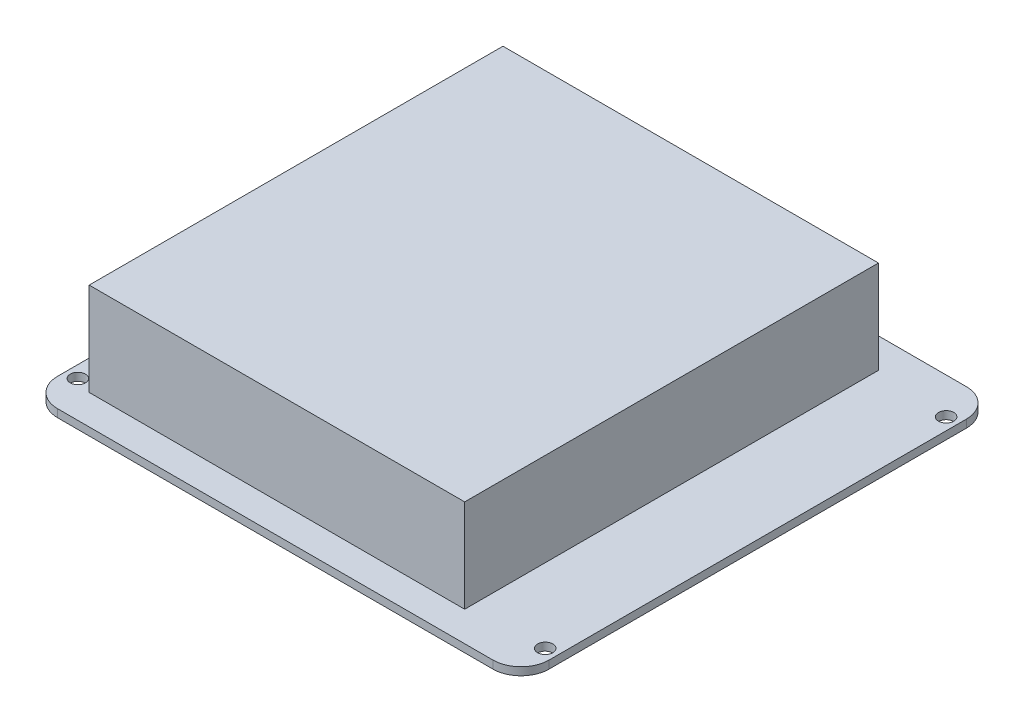
ISO-10303-21;
HEADER;
FILE_DESCRIPTION(('STEP AP214'),'2;1');
FILE_NAME('part.step','',(''),(''),'','','');
FILE_SCHEMA(('AUTOMOTIVE_DESIGN { 1 0 10303 214 1 1 1 1 }'));
ENDSEC;
DATA;
#1=APPLICATION_CONTEXT('core data for automotive mechanical design processes');
#2=APPLICATION_PROTOCOL_DEFINITION('international standard','automotive_design',2000,#1);
#3=PRODUCT_CONTEXT('',#1,'mechanical');
#4=PRODUCT('Part','Part','',(#3));
#5=PRODUCT_RELATED_PRODUCT_CATEGORY('part','',(#4));
#6=PRODUCT_DEFINITION_FORMATION('','',#4);
#7=PRODUCT_DEFINITION_CONTEXT('part definition',#1,'design');
#8=PRODUCT_DEFINITION('design','',#6,#7);
#9=PRODUCT_DEFINITION_SHAPE('','',#8);
#10=(LENGTH_UNIT() NAMED_UNIT(*) SI_UNIT(.MILLI.,.METRE.));
#11=(NAMED_UNIT(*) PLANE_ANGLE_UNIT() SI_UNIT($,.RADIAN.));
#12=(NAMED_UNIT(*) SI_UNIT($,.STERADIAN.) SOLID_ANGLE_UNIT());
#13=UNCERTAINTY_MEASURE_WITH_UNIT(LENGTH_MEASURE(1.E-05),#10,'distance_accuracy_value','');
#14=(GEOMETRIC_REPRESENTATION_CONTEXT(3) GLOBAL_UNCERTAINTY_ASSIGNED_CONTEXT((#13)) GLOBAL_UNIT_ASSIGNED_CONTEXT((#10,
#11,#12)) REPRESENTATION_CONTEXT('',''));
#15=CARTESIAN_POINT('',(0.,0.,0.));
#16=DIRECTION('',(0.,0.,1.));
#17=DIRECTION('',(1.,0.,0.));
#18=AXIS2_PLACEMENT_3D('',#15,#16,#17);
#19=CARTESIAN_POINT('',(0.,0.,0.));
#20=DIRECTION('',(0.,1.,0.));
#21=DIRECTION('',(0.,0.,1.));
#22=AXIS2_PLACEMENT_3D('',#19,#20,#21);
#23=PLANE('',#22);
#24=CARTESIAN_POINT('',(47.5,0.,40.75));
#25=DIRECTION('',(0.,1.,0.));
#26=DIRECTION('',(0.,0.,1.));
#27=AXIS2_PLACEMENT_3D('',#24,#25,#26);
#28=CIRCLE('',#27,1.54999999999999);
#29=CARTESIAN_POINT('',(47.5,0.,42.3));
#30=VERTEX_POINT('',#29);
#31=EDGE_CURVE('E194',#30,#30,#28,.T.);
#32=ORIENTED_EDGE('',*,*,#31,.T.);
#33=EDGE_LOOP('',(#32));
#34=FACE_BOUND('',#33,.T.);
#35=CARTESIAN_POINT('',(-47.5,0.,40.75));
#36=DIRECTION('',(0.,1.,0.));
#37=DIRECTION('',(0.,0.,1.));
#38=AXIS2_PLACEMENT_3D('',#35,#36,#37);
#39=CIRCLE('',#38,1.55);
#40=CARTESIAN_POINT('',(-47.5,0.,42.3));
#41=VERTEX_POINT('',#40);
#42=EDGE_CURVE('E210',#41,#41,#39,.T.);
#43=ORIENTED_EDGE('',*,*,#42,.T.);
#44=EDGE_LOOP('',(#43));
#45=FACE_BOUND('',#44,.T.);
#46=CARTESIAN_POINT('',(-47.5,0.,-40.75));
#47=DIRECTION('',(0.,1.,0.));
#48=DIRECTION('',(0.,0.,1.));
#49=AXIS2_PLACEMENT_3D('',#46,#47,#48);
#50=CIRCLE('',#49,1.55);
#51=CARTESIAN_POINT('',(-47.5,0.,-39.2));
#52=VERTEX_POINT('',#51);
#53=EDGE_CURVE('E216',#52,#52,#50,.T.);
#54=ORIENTED_EDGE('',*,*,#53,.T.);
#55=EDGE_LOOP('',(#54));
#56=FACE_BOUND('',#55,.T.);
#57=CARTESIAN_POINT('',(47.5,0.,-40.75));
#58=DIRECTION('',(0.,1.,0.));
#59=DIRECTION('',(0.,0.,1.));
#60=AXIS2_PLACEMENT_3D('',#57,#58,#59);
#61=CIRCLE('',#60,1.54999999999999);
#62=CARTESIAN_POINT('',(47.5,0.,-39.2));
#63=VERTEX_POINT('',#62);
#64=EDGE_CURVE('E222',#63,#63,#61,.T.);
#65=ORIENTED_EDGE('',*,*,#64,.T.);
#66=EDGE_LOOP('',(#65));
#67=FACE_BOUND('',#66,.T.);
#68=DIRECTION('',(-1.,0.,0.));
#69=VECTOR('',#68,1.);
#70=CARTESIAN_POINT('',(-49.955000039,0.,-48.125));
#71=LINE('',#70,#69);
#72=CARTESIAN_POINT('',(44.255000039,0.,-48.125));
#73=VERTEX_POINT('',#72);
#74=CARTESIAN_POINT('',(-44.255000039,0.,-48.125));
#75=VERTEX_POINT('',#74);
#76=EDGE_CURVE('E235',#73,#75,#71,.T.);
#77=ORIENTED_EDGE('',*,*,#76,.F.);
#78=CARTESIAN_POINT('',(44.255000039,0.,-42.425));
#79=DIRECTION('',(0.,1.,0.));
#80=DIRECTION('',(0.,0.,1.));
#81=AXIS2_PLACEMENT_3D('',#78,#79,#80);
#82=CIRCLE('',#81,5.7);
#83=CARTESIAN_POINT('',(49.955000039,0.,-42.425));
#84=VERTEX_POINT('',#83);
#85=EDGE_CURVE('E265',#73,#84,#82,.F.);
#86=ORIENTED_EDGE('',*,*,#85,.T.);
#87=DIRECTION('',(0.,0.,-1.));
#88=VECTOR('',#87,1.);
#89=CARTESIAN_POINT('',(49.955000039,0.,-48.125));
#90=LINE('',#89,#88);
#91=CARTESIAN_POINT('',(49.9550000390001,0.,42.425));
#92=VERTEX_POINT('',#91);
#93=EDGE_CURVE('E250',#92,#84,#90,.T.);
#94=ORIENTED_EDGE('',*,*,#93,.F.);
#95=CARTESIAN_POINT('',(44.2550000390001,0.,42.425));
#96=DIRECTION('',(0.,1.,0.));
#97=DIRECTION('',(0.,0.,1.));
#98=AXIS2_PLACEMENT_3D('',#95,#96,#97);
#99=CIRCLE('',#98,5.7);
#100=CARTESIAN_POINT('',(44.2550000390001,0.,48.125));
#101=VERTEX_POINT('',#100);
#102=EDGE_CURVE('E263',#92,#101,#99,.F.);
#103=ORIENTED_EDGE('',*,*,#102,.T.);
#104=DIRECTION('',(1.,0.,0.));
#105=VECTOR('',#104,1.);
#106=CARTESIAN_POINT('',(-49.955000039,0.,48.125));
#107=LINE('',#106,#105);
#108=CARTESIAN_POINT('',(-44.255000039,0.,48.125));
#109=VERTEX_POINT('',#108);
#110=EDGE_CURVE('E247',#109,#101,#107,.T.);
#111=ORIENTED_EDGE('',*,*,#110,.F.);
#112=CARTESIAN_POINT('',(-44.255000039,0.,42.425));
#113=DIRECTION('',(0.,1.,0.));
#114=DIRECTION('',(0.,0.,1.));
#115=AXIS2_PLACEMENT_3D('',#112,#113,#114);
#116=CIRCLE('',#115,5.7);
#117=CARTESIAN_POINT('',(-49.955000039,0.,42.425));
#118=VERTEX_POINT('',#117);
#119=EDGE_CURVE('E259',#109,#118,#116,.F.);
#120=ORIENTED_EDGE('',*,*,#119,.T.);
#121=DIRECTION('',(0.,0.,1.));
#122=VECTOR('',#121,1.);
#123=CARTESIAN_POINT('',(-49.955000039,0.,-48.125));
#124=LINE('',#123,#122);
#125=CARTESIAN_POINT('',(-49.955000039,0.,-42.425));
#126=VERTEX_POINT('',#125);
#127=EDGE_CURVE('E228',#126,#118,#124,.T.);
#128=ORIENTED_EDGE('',*,*,#127,.F.);
#129=CARTESIAN_POINT('',(-44.255000039,0.,-42.425));
#130=DIRECTION('',(0.,1.,0.));
#131=DIRECTION('',(0.,0.,1.));
#132=AXIS2_PLACEMENT_3D('',#129,#130,#131);
#133=CIRCLE('',#132,5.7);
#134=EDGE_CURVE('E261',#126,#75,#133,.F.);
#135=ORIENTED_EDGE('',*,*,#134,.T.);
#136=EDGE_LOOP('',(#77,#86,#94,#103,#111,#120,#128,#135));
#137=FACE_BOUND('',#136,.T.);
#138=DIRECTION('',(0.,0.,1.));
#139=VECTOR('',#138,1.);
#140=CARTESIAN_POINT('',(-7.135000039,0.,6.22500000000002));
#141=LINE('',#140,#139);
#142=CARTESIAN_POINT('',(-7.135000039,0.,-0.324999999999982));
#143=VERTEX_POINT('',#142);
#144=CARTESIAN_POINT('',(-7.135000039,0.,6.22500000000002));
#145=VERTEX_POINT('',#144);
#146=EDGE_CURVE('E168',#143,#145,#141,.T.);
#147=ORIENTED_EDGE('',*,*,#146,.F.);
#148=DIRECTION('',(1.,0.,0.));
#149=VECTOR('',#148,1.);
#150=CARTESIAN_POINT('',(-7.135000039,0.,-0.324999999999982));
#151=LINE('',#150,#149);
#152=CARTESIAN_POINT('',(-14.095000039,0.,-0.324999999999983));
#153=VERTEX_POINT('',#152);
#154=EDGE_CURVE('E165',#153,#143,#151,.T.);
#155=ORIENTED_EDGE('',*,*,#154,.F.);
#156=DIRECTION('',(0.,0.,-1.));
#157=VECTOR('',#156,1.);
#158=CARTESIAN_POINT('',(-14.095000039,0.,6.22500000000001));
#159=LINE('',#158,#157);
#160=CARTESIAN_POINT('',(-14.095000039,0.,6.22500000000001));
#161=VERTEX_POINT('',#160);
#162=EDGE_CURVE('E55',#161,#153,#159,.T.);
#163=ORIENTED_EDGE('',*,*,#162,.F.);
#164=DIRECTION('',(-1.,0.,0.));
#165=VECTOR('',#164,1.);
#166=CARTESIAN_POINT('',(-7.135000039,0.,6.22500000000002));
#167=LINE('',#166,#165);
#168=EDGE_CURVE('E50',#145,#161,#167,.T.);
#169=ORIENTED_EDGE('',*,*,#168,.F.);
#170=EDGE_LOOP('',(#147,#155,#163,#169));
#171=FACE_BOUND('',#170,.T.);
#172=ADVANCED_FACE('F35',(#34,#45,#56,#67,#137,#171),#23,.F.);
#173=CARTESIAN_POINT('',(0.,1.6,0.));
#174=DIRECTION('',(0.,1.,0.));
#175=DIRECTION('',(0.,0.,1.));
#176=AXIS2_PLACEMENT_3D('',#173,#174,#175);
#177=PLANE('',#176);
#178=CARTESIAN_POINT('',(-47.5,1.6,40.75));
#179=DIRECTION('',(0.,1.,0.));
#180=DIRECTION('',(0.,0.,1.));
#181=AXIS2_PLACEMENT_3D('',#178,#179,#180);
#182=CIRCLE('',#181,1.55);
#183=CARTESIAN_POINT('',(-47.5,1.6,42.3));
#184=VERTEX_POINT('',#183);
#185=EDGE_CURVE('E213',#184,#184,#182,.T.);
#186=ORIENTED_EDGE('',*,*,#185,.F.);
#187=EDGE_LOOP('',(#186));
#188=FACE_BOUND('',#187,.T.);
#189=CARTESIAN_POINT('',(47.5,1.6,-40.75));
#190=DIRECTION('',(0.,1.,0.));
#191=DIRECTION('',(0.,0.,1.));
#192=AXIS2_PLACEMENT_3D('',#189,#190,#191);
#193=CIRCLE('',#192,1.54999999999999);
#194=CARTESIAN_POINT('',(47.5,1.6,-39.2));
#195=VERTEX_POINT('',#194);
#196=EDGE_CURVE('E225',#195,#195,#193,.T.);
#197=ORIENTED_EDGE('',*,*,#196,.F.);
#198=EDGE_LOOP('',(#197));
#199=FACE_BOUND('',#198,.T.);
#200=DIRECTION('',(0.,0.,-1.));
#201=VECTOR('',#200,1.);
#202=CARTESIAN_POINT('',(49.955000039,1.6,-48.125));
#203=LINE('',#202,#201);
#204=CARTESIAN_POINT('',(49.9550000390001,1.6,42.425));
#205=VERTEX_POINT('',#204);
#206=CARTESIAN_POINT('',(49.955000039,1.6,-42.425));
#207=VERTEX_POINT('',#206);
#208=EDGE_CURVE('E238',#205,#207,#203,.T.);
#209=ORIENTED_EDGE('',*,*,#208,.T.);
#210=CARTESIAN_POINT('',(44.255000039,1.6,-42.425));
#211=DIRECTION('',(0.,1.,0.));
#212=DIRECTION('',(0.,0.,1.));
#213=AXIS2_PLACEMENT_3D('',#210,#211,#212);
#214=CIRCLE('',#213,5.7);
#215=CARTESIAN_POINT('',(44.255000039,1.6,-48.125));
#216=VERTEX_POINT('',#215);
#217=EDGE_CURVE('E278',#207,#216,#214,.T.);
#218=ORIENTED_EDGE('',*,*,#217,.T.);
#219=DIRECTION('',(-1.,0.,0.));
#220=VECTOR('',#219,1.);
#221=CARTESIAN_POINT('',(-49.955000039,1.6,-48.125));
#222=LINE('',#221,#220);
#223=CARTESIAN_POINT('',(-44.255000039,1.6,-48.125));
#224=VERTEX_POINT('',#223);
#225=EDGE_CURVE('E241',#216,#224,#222,.T.);
#226=ORIENTED_EDGE('',*,*,#225,.T.);
#227=CARTESIAN_POINT('',(-44.255000039,1.6,-42.425));
#228=DIRECTION('',(0.,1.,0.));
#229=DIRECTION('',(0.,0.,1.));
#230=AXIS2_PLACEMENT_3D('',#227,#228,#229);
#231=CIRCLE('',#230,5.7);
#232=CARTESIAN_POINT('',(-49.955000039,1.6,-42.425));
#233=VERTEX_POINT('',#232);
#234=EDGE_CURVE('E274',#224,#233,#231,.T.);
#235=ORIENTED_EDGE('',*,*,#234,.T.);
#236=DIRECTION('',(0.,0.,1.));
#237=VECTOR('',#236,1.);
#238=CARTESIAN_POINT('',(-49.955000039,1.6,-48.125));
#239=LINE('',#238,#237);
#240=CARTESIAN_POINT('',(-49.955000039,1.6,42.425));
#241=VERTEX_POINT('',#240);
#242=EDGE_CURVE('E231',#233,#241,#239,.T.);
#243=ORIENTED_EDGE('',*,*,#242,.T.);
#244=CARTESIAN_POINT('',(-44.255000039,1.6,42.425));
#245=DIRECTION('',(0.,1.,0.));
#246=DIRECTION('',(0.,0.,1.));
#247=AXIS2_PLACEMENT_3D('',#244,#245,#246);
#248=CIRCLE('',#247,5.7);
#249=CARTESIAN_POINT('',(-44.255000039,1.6,48.125));
#250=VERTEX_POINT('',#249);
#251=EDGE_CURVE('E272',#241,#250,#248,.T.);
#252=ORIENTED_EDGE('',*,*,#251,.T.);
#253=DIRECTION('',(1.,0.,0.));
#254=VECTOR('',#253,1.);
#255=CARTESIAN_POINT('',(-49.955000039,1.6,48.125));
#256=LINE('',#255,#254);
#257=CARTESIAN_POINT('',(44.2550000390001,1.6,48.125));
#258=VERTEX_POINT('',#257);
#259=EDGE_CURVE('E234',#250,#258,#256,.T.);
#260=ORIENTED_EDGE('',*,*,#259,.T.);
#261=CARTESIAN_POINT('',(44.2550000390001,1.6,42.425));
#262=DIRECTION('',(0.,1.,0.));
#263=DIRECTION('',(0.,0.,1.));
#264=AXIS2_PLACEMENT_3D('',#261,#262,#263);
#265=CIRCLE('',#264,5.7);
#266=EDGE_CURVE('E276',#258,#205,#265,.T.);
#267=ORIENTED_EDGE('',*,*,#266,.T.);
#268=EDGE_LOOP('',(#209,#218,#226,#235,#243,#252,#260,#267));
#269=FACE_BOUND('',#268,.T.);
#270=CARTESIAN_POINT('',(-47.5,1.6,-40.75));
#271=DIRECTION('',(0.,1.,0.));
#272=DIRECTION('',(0.,0.,1.));
#273=AXIS2_PLACEMENT_3D('',#270,#271,#272);
#274=CIRCLE('',#273,1.55);
#275=CARTESIAN_POINT('',(-47.5,1.6,-39.2));
#276=VERTEX_POINT('',#275);
#277=EDGE_CURVE('E219',#276,#276,#274,.T.);
#278=ORIENTED_EDGE('',*,*,#277,.F.);
#279=EDGE_LOOP('',(#278));
#280=FACE_BOUND('',#279,.T.);
#281=CARTESIAN_POINT('',(47.5,1.6,40.75));
#282=DIRECTION('',(0.,1.,0.));
#283=DIRECTION('',(0.,0.,1.));
#284=AXIS2_PLACEMENT_3D('',#281,#282,#283);
#285=CIRCLE('',#284,1.54999999999999);
#286=CARTESIAN_POINT('',(47.5,1.6,42.3));
#287=VERTEX_POINT('',#286);
#288=EDGE_CURVE('E207',#287,#287,#285,.T.);
#289=ORIENTED_EDGE('',*,*,#288,.F.);
#290=EDGE_LOOP('',(#289));
#291=FACE_BOUND('',#290,.T.);
#292=DIRECTION('',(-1.,0.,0.));
#293=VECTOR('',#292,1.);
#294=CARTESIAN_POINT('',(32.434999961,1.6,-42.055));
#295=LINE('',#294,#293);
#296=CARTESIAN_POINT('',(32.434999961,1.6,-42.055));
#297=VERTEX_POINT('',#296);
#298=CARTESIAN_POINT('',(-43.895000039,1.6,-42.055));
#299=VERTEX_POINT('',#298);
#300=EDGE_CURVE('E185',#297,#299,#295,.T.);
#301=ORIENTED_EDGE('',*,*,#300,.F.);
#302=DIRECTION('',(0.,0.,-1.));
#303=VECTOR('',#302,1.);
#304=CARTESIAN_POINT('',(32.434999961,1.6,42.055));
#305=LINE('',#304,#303);
#306=CARTESIAN_POINT('',(32.434999961,1.6,42.055));
#307=VERTEX_POINT('',#306);
#308=EDGE_CURVE('E171',#307,#297,#305,.T.);
#309=ORIENTED_EDGE('',*,*,#308,.F.);
#310=DIRECTION('',(1.,0.,0.));
#311=VECTOR('',#310,1.);
#312=CARTESIAN_POINT('',(32.434999961,1.6,42.055));
#313=LINE('',#312,#311);
#314=CARTESIAN_POINT('',(-43.895000039,1.6,42.055));
#315=VERTEX_POINT('',#314);
#316=EDGE_CURVE('E177',#315,#307,#313,.T.);
#317=ORIENTED_EDGE('',*,*,#316,.F.);
#318=DIRECTION('',(0.,0.,1.));
#319=VECTOR('',#318,1.);
#320=CARTESIAN_POINT('',(-43.895000039,1.6,42.055));
#321=LINE('',#320,#319);
#322=EDGE_CURVE('E182',#299,#315,#321,.T.);
#323=ORIENTED_EDGE('',*,*,#322,.F.);
#324=EDGE_LOOP('',(#301,#309,#317,#323));
#325=FACE_BOUND('',#324,.T.);
#326=ADVANCED_FACE('F293',(#188,#199,#269,#280,#291,#325),#177,.T.);
#327=CARTESIAN_POINT('',(-49.955000039,1.6,-48.125));
#328=DIRECTION('',(1.,0.,0.));
#329=DIRECTION('',(0.,0.,-1.));
#330=AXIS2_PLACEMENT_3D('',#327,#328,#329);
#331=PLANE('',#330);
#332=ORIENTED_EDGE('',*,*,#242,.F.);
#333=DIRECTION('',(0.,-1.,0.));
#334=VECTOR('',#333,1.);
#335=CARTESIAN_POINT('',(-49.955000039,1.6,-42.425));
#336=LINE('',#335,#334);
#337=EDGE_CURVE('E12',#233,#126,#336,.T.);
#338=ORIENTED_EDGE('',*,*,#337,.T.);
#339=ORIENTED_EDGE('',*,*,#127,.T.);
#340=DIRECTION('',(0.,-1.,0.));
#341=VECTOR('',#340,1.);
#342=CARTESIAN_POINT('',(-49.955000039,1.6,42.425));
#343=LINE('',#342,#341);
#344=EDGE_CURVE('E43',#118,#241,#343,.F.);
#345=ORIENTED_EDGE('',*,*,#344,.T.);
#346=EDGE_LOOP('',(#332,#338,#339,#345));
#347=FACE_BOUND('',#346,.T.);
#348=ADVANCED_FACE('F287',(#347),#331,.F.);
#349=CARTESIAN_POINT('',(-49.955000039,1.6,48.125));
#350=DIRECTION('',(0.,0.,-1.));
#351=DIRECTION('',(-1.,0.,0.));
#352=AXIS2_PLACEMENT_3D('',#349,#350,#351);
#353=PLANE('',#352);
#354=ORIENTED_EDGE('',*,*,#110,.T.);
#355=DIRECTION('',(0.,-1.,0.));
#356=VECTOR('',#355,1.);
#357=CARTESIAN_POINT('',(44.2550000390001,1.6,48.125));
#358=LINE('',#357,#356);
#359=EDGE_CURVE('E283',#101,#258,#358,.F.);
#360=ORIENTED_EDGE('',*,*,#359,.T.);
#361=ORIENTED_EDGE('',*,*,#259,.F.);
#362=DIRECTION('',(0.,-1.,0.));
#363=VECTOR('',#362,1.);
#364=CARTESIAN_POINT('',(-44.255000039,1.6,48.125));
#365=LINE('',#364,#363);
#366=EDGE_CURVE('E280',#250,#109,#365,.T.);
#367=ORIENTED_EDGE('',*,*,#366,.T.);
#368=EDGE_LOOP('',(#354,#360,#361,#367));
#369=FACE_BOUND('',#368,.T.);
#370=ADVANCED_FACE('F300',(#369),#353,.F.);
#371=CARTESIAN_POINT('',(49.955000039,1.6,-48.125));
#372=DIRECTION('',(-1.,0.,0.));
#373=DIRECTION('',(0.,0.,1.));
#374=AXIS2_PLACEMENT_3D('',#371,#372,#373);
#375=PLANE('',#374);
#376=ORIENTED_EDGE('',*,*,#93,.T.);
#377=DIRECTION('',(0.,-1.,0.));
#378=VECTOR('',#377,1.);
#379=CARTESIAN_POINT('',(49.955000039,1.6,-42.425));
#380=LINE('',#379,#378);
#381=EDGE_CURVE('E270',#84,#207,#380,.F.);
#382=ORIENTED_EDGE('',*,*,#381,.T.);
#383=ORIENTED_EDGE('',*,*,#208,.F.);
#384=DIRECTION('',(0.,-1.,0.));
#385=VECTOR('',#384,1.);
#386=CARTESIAN_POINT('',(49.9550000390001,1.6,42.425));
#387=LINE('',#386,#385);
#388=EDGE_CURVE('E267',#205,#92,#387,.T.);
#389=ORIENTED_EDGE('',*,*,#388,.T.);
#390=EDGE_LOOP('',(#376,#382,#383,#389));
#391=FACE_BOUND('',#390,.T.);
#392=ADVANCED_FACE('F311',(#391),#375,.F.);
#393=CARTESIAN_POINT('',(-49.955000039,1.6,-48.125));
#394=DIRECTION('',(0.,0.,1.));
#395=DIRECTION('',(1.,0.,0.));
#396=AXIS2_PLACEMENT_3D('',#393,#394,#395);
#397=PLANE('',#396);
#398=ORIENTED_EDGE('',*,*,#225,.F.);
#399=DIRECTION('',(0.,-1.,0.));
#400=VECTOR('',#399,1.);
#401=CARTESIAN_POINT('',(44.255000039,1.6,-48.125));
#402=LINE('',#401,#400);
#403=EDGE_CURVE('E256',#216,#73,#402,.T.);
#404=ORIENTED_EDGE('',*,*,#403,.T.);
#405=ORIENTED_EDGE('',*,*,#76,.T.);
#406=DIRECTION('',(0.,-1.,0.));
#407=VECTOR('',#406,1.);
#408=CARTESIAN_POINT('',(-44.255000039,1.6,-48.125));
#409=LINE('',#408,#407);
#410=EDGE_CURVE('E244',#75,#224,#409,.F.);
#411=ORIENTED_EDGE('',*,*,#410,.T.);
#412=EDGE_LOOP('',(#398,#404,#405,#411));
#413=FACE_BOUND('',#412,.T.);
#414=ADVANCED_FACE('F319',(#413),#397,.F.);
#415=CARTESIAN_POINT('',(47.5,1.6,-40.75));
#416=DIRECTION('',(0.,-1.,0.));
#417=DIRECTION('',(0.,0.,-1.));
#418=AXIS2_PLACEMENT_3D('',#415,#416,#417);
#419=CYLINDRICAL_SURFACE('',#418,1.54999999999999);
#420=ORIENTED_EDGE('',*,*,#196,.T.);
#421=EDGE_LOOP('',(#420));
#422=FACE_BOUND('',#421,.T.);
#423=ORIENTED_EDGE('',*,*,#64,.F.);
#424=EDGE_LOOP('',(#423));
#425=FACE_BOUND('',#424,.T.);
#426=ADVANCED_FACE('F345',(#422,#425),#419,.F.);
#427=CARTESIAN_POINT('',(-47.5,1.6,-40.75));
#428=DIRECTION('',(0.,-1.,0.));
#429=DIRECTION('',(0.,0.,-1.));
#430=AXIS2_PLACEMENT_3D('',#427,#428,#429);
#431=CYLINDRICAL_SURFACE('',#430,1.55);
#432=ORIENTED_EDGE('',*,*,#277,.T.);
#433=EDGE_LOOP('',(#432));
#434=FACE_BOUND('',#433,.T.);
#435=ORIENTED_EDGE('',*,*,#53,.F.);
#436=EDGE_LOOP('',(#435));
#437=FACE_BOUND('',#436,.T.);
#438=ADVANCED_FACE('F363',(#434,#437),#431,.F.);
#439=CARTESIAN_POINT('',(-47.5,1.6,40.75));
#440=DIRECTION('',(0.,-1.,0.));
#441=DIRECTION('',(0.,0.,-1.));
#442=AXIS2_PLACEMENT_3D('',#439,#440,#441);
#443=CYLINDRICAL_SURFACE('',#442,1.55);
#444=ORIENTED_EDGE('',*,*,#185,.T.);
#445=EDGE_LOOP('',(#444));
#446=FACE_BOUND('',#445,.T.);
#447=ORIENTED_EDGE('',*,*,#42,.F.);
#448=EDGE_LOOP('',(#447));
#449=FACE_BOUND('',#448,.T.);
#450=ADVANCED_FACE('F357',(#446,#449),#443,.F.);
#451=CARTESIAN_POINT('',(47.5,1.6,40.75));
#452=DIRECTION('',(0.,-1.,0.));
#453=DIRECTION('',(0.,0.,-1.));
#454=AXIS2_PLACEMENT_3D('',#451,#452,#453);
#455=CYLINDRICAL_SURFACE('',#454,1.54999999999999);
#456=ORIENTED_EDGE('',*,*,#288,.T.);
#457=EDGE_LOOP('',(#456));
#458=FACE_BOUND('',#457,.T.);
#459=ORIENTED_EDGE('',*,*,#31,.F.);
#460=EDGE_LOOP('',(#459));
#461=FACE_BOUND('',#460,.T.);
#462=ADVANCED_FACE('F353',(#458,#461),#455,.F.);
#463=CARTESIAN_POINT('',(44.255000039,1.6,-42.425));
#464=DIRECTION('',(0.,-1.,0.));
#465=DIRECTION('',(0.,0.,-1.));
#466=AXIS2_PLACEMENT_3D('',#463,#464,#465);
#467=CYLINDRICAL_SURFACE('',#466,5.7);
#468=ORIENTED_EDGE('',*,*,#217,.F.);
#469=ORIENTED_EDGE('',*,*,#381,.F.);
#470=ORIENTED_EDGE('',*,*,#85,.F.);
#471=ORIENTED_EDGE('',*,*,#403,.F.);
#472=EDGE_LOOP('',(#468,#469,#470,#471));
#473=FACE_BOUND('',#472,.T.);
#474=ADVANCED_FACE('F317',(#473),#467,.T.);
#475=CARTESIAN_POINT('',(44.2550000390001,1.6,42.425));
#476=DIRECTION('',(0.,-1.,0.));
#477=DIRECTION('',(0.,0.,-1.));
#478=AXIS2_PLACEMENT_3D('',#475,#476,#477);
#479=CYLINDRICAL_SURFACE('',#478,5.7);
#480=ORIENTED_EDGE('',*,*,#266,.F.);
#481=ORIENTED_EDGE('',*,*,#359,.F.);
#482=ORIENTED_EDGE('',*,*,#102,.F.);
#483=ORIENTED_EDGE('',*,*,#388,.F.);
#484=EDGE_LOOP('',(#480,#481,#482,#483));
#485=FACE_BOUND('',#484,.T.);
#486=ADVANCED_FACE('F308',(#485),#479,.T.);
#487=CARTESIAN_POINT('',(-44.255000039,1.6,-42.425));
#488=DIRECTION('',(0.,-1.,0.));
#489=DIRECTION('',(0.,0.,-1.));
#490=AXIS2_PLACEMENT_3D('',#487,#488,#489);
#491=CYLINDRICAL_SURFACE('',#490,5.7);
#492=ORIENTED_EDGE('',*,*,#234,.F.);
#493=ORIENTED_EDGE('',*,*,#410,.F.);
#494=ORIENTED_EDGE('',*,*,#134,.F.);
#495=ORIENTED_EDGE('',*,*,#337,.F.);
#496=EDGE_LOOP('',(#492,#493,#494,#495));
#497=FACE_BOUND('',#496,.T.);
#498=ADVANCED_FACE('F322',(#497),#491,.T.);
#499=CARTESIAN_POINT('',(-44.255000039,1.6,42.425));
#500=DIRECTION('',(0.,-1.,0.));
#501=DIRECTION('',(0.,0.,-1.));
#502=AXIS2_PLACEMENT_3D('',#499,#500,#501);
#503=CYLINDRICAL_SURFACE('',#502,5.7);
#504=ORIENTED_EDGE('',*,*,#251,.F.);
#505=ORIENTED_EDGE('',*,*,#344,.F.);
#506=ORIENTED_EDGE('',*,*,#119,.F.);
#507=ORIENTED_EDGE('',*,*,#366,.F.);
#508=EDGE_LOOP('',(#504,#505,#506,#507));
#509=FACE_BOUND('',#508,.T.);
#510=ADVANCED_FACE('F37',(#509),#503,.T.);
#511=CARTESIAN_POINT('',(32.434999961,154.581516982298,42.055));
#512=DIRECTION('',(-1.,0.,0.));
#513=DIRECTION('',(0.,0.,1.));
#514=AXIS2_PLACEMENT_3D('',#511,#512,#513);
#515=PLANE('',#514);
#516=DIRECTION('',(0.,0.,-1.));
#517=VECTOR('',#516,1.);
#518=CARTESIAN_POINT('',(32.434999961,20.5,42.055));
#519=LINE('',#518,#517);
#520=CARTESIAN_POINT('',(32.434999961,20.5,42.055));
#521=VERTEX_POINT('',#520);
#522=CARTESIAN_POINT('',(32.434999961,20.5,-42.055));
#523=VERTEX_POINT('',#522);
#524=EDGE_CURVE('E198',#521,#523,#519,.T.);
#525=ORIENTED_EDGE('',*,*,#524,.F.);
#526=DIRECTION('',(0.,-1.,0.));
#527=VECTOR('',#526,1.);
#528=CARTESIAN_POINT('',(32.434999961,154.581516982298,42.055));
#529=LINE('',#528,#527);
#530=EDGE_CURVE('E169',#521,#307,#529,.T.);
#531=ORIENTED_EDGE('',*,*,#530,.T.);
#532=ORIENTED_EDGE('',*,*,#308,.T.);
#533=DIRECTION('',(0.,-1.,0.));
#534=VECTOR('',#533,1.);
#535=CARTESIAN_POINT('',(32.434999961,154.581516982298,-42.055));
#536=LINE('',#535,#534);
#537=EDGE_CURVE('E188',#523,#297,#536,.T.);
#538=ORIENTED_EDGE('',*,*,#537,.F.);
#539=EDGE_LOOP('',(#525,#531,#532,#538));
#540=FACE_BOUND('',#539,.T.);
#541=ADVANCED_FACE('F328',(#540),#515,.F.);
#542=CARTESIAN_POINT('',(32.434999961,154.581516982298,-42.055));
#543=DIRECTION('',(0.,0.,1.));
#544=DIRECTION('',(1.,0.,0.));
#545=AXIS2_PLACEMENT_3D('',#542,#543,#544);
#546=PLANE('',#545);
#547=DIRECTION('',(-1.,0.,0.));
#548=VECTOR('',#547,1.);
#549=CARTESIAN_POINT('',(32.434999961,20.5,-42.055));
#550=LINE('',#549,#548);
#551=CARTESIAN_POINT('',(-43.895000039,20.5,-42.055));
#552=VERTEX_POINT('',#551);
#553=EDGE_CURVE('E195',#523,#552,#550,.T.);
#554=ORIENTED_EDGE('',*,*,#553,.F.);
#555=ORIENTED_EDGE('',*,*,#537,.T.);
#556=ORIENTED_EDGE('',*,*,#300,.T.);
#557=DIRECTION('',(0.,-1.,0.));
#558=VECTOR('',#557,1.);
#559=CARTESIAN_POINT('',(-43.895000039,154.581516982298,-42.055));
#560=LINE('',#559,#558);
#561=EDGE_CURVE('E184',#552,#299,#560,.T.);
#562=ORIENTED_EDGE('',*,*,#561,.F.);
#563=EDGE_LOOP('',(#554,#555,#556,#562));
#564=FACE_BOUND('',#563,.T.);
#565=ADVANCED_FACE('F453',(#564),#546,.F.);
#566=CARTESIAN_POINT('',(-43.895000039,154.581516982298,42.055));
#567=DIRECTION('',(1.,0.,0.));
#568=DIRECTION('',(0.,0.,-1.));
#569=AXIS2_PLACEMENT_3D('',#566,#567,#568);
#570=PLANE('',#569);
#571=DIRECTION('',(0.,0.,1.));
#572=VECTOR('',#571,1.);
#573=CARTESIAN_POINT('',(-43.895000039,20.5,42.055));
#574=LINE('',#573,#572);
#575=CARTESIAN_POINT('',(-43.895000039,20.5,42.055));
#576=VERTEX_POINT('',#575);
#577=EDGE_CURVE('E191',#552,#576,#574,.T.);
#578=ORIENTED_EDGE('',*,*,#577,.F.);
#579=ORIENTED_EDGE('',*,*,#561,.T.);
#580=ORIENTED_EDGE('',*,*,#322,.T.);
#581=DIRECTION('',(0.,-1.,0.));
#582=VECTOR('',#581,1.);
#583=CARTESIAN_POINT('',(-43.895000039,154.581516982298,42.055));
#584=LINE('',#583,#582);
#585=EDGE_CURVE('E181',#576,#315,#584,.T.);
#586=ORIENTED_EDGE('',*,*,#585,.F.);
#587=EDGE_LOOP('',(#578,#579,#580,#586));
#588=FACE_BOUND('',#587,.T.);
#589=ADVANCED_FACE('F462',(#588),#570,.F.);
#590=CARTESIAN_POINT('',(32.434999961,154.581516982298,42.055));
#591=DIRECTION('',(0.,0.,-1.));
#592=DIRECTION('',(-1.,0.,0.));
#593=AXIS2_PLACEMENT_3D('',#590,#591,#592);
#594=PLANE('',#593);
#595=DIRECTION('',(1.,0.,0.));
#596=VECTOR('',#595,1.);
#597=CARTESIAN_POINT('',(32.434999961,20.5,42.055));
#598=LINE('',#597,#596);
#599=EDGE_CURVE('E180',#576,#521,#598,.T.);
#600=ORIENTED_EDGE('',*,*,#599,.F.);
#601=ORIENTED_EDGE('',*,*,#585,.T.);
#602=ORIENTED_EDGE('',*,*,#316,.T.);
#603=ORIENTED_EDGE('',*,*,#530,.F.);
#604=EDGE_LOOP('',(#600,#601,#602,#603));
#605=FACE_BOUND('',#604,.T.);
#606=ADVANCED_FACE('F472',(#605),#594,.F.);
#607=CARTESIAN_POINT('',(0.,20.5,0.));
#608=DIRECTION('',(0.,1.,0.));
#609=DIRECTION('',(0.,0.,1.));
#610=AXIS2_PLACEMENT_3D('',#607,#608,#609);
#611=PLANE('',#610);
#612=ORIENTED_EDGE('',*,*,#599,.T.);
#613=ORIENTED_EDGE('',*,*,#524,.T.);
#614=ORIENTED_EDGE('',*,*,#553,.T.);
#615=ORIENTED_EDGE('',*,*,#577,.T.);
#616=EDGE_LOOP('',(#612,#613,#614,#615));
#617=FACE_BOUND('',#616,.T.);
#618=ADVANCED_FACE('F368',(#617),#611,.T.);
#619=CARTESIAN_POINT('',(-7.135000039,-5.15,6.22500000000002));
#620=DIRECTION('',(-1.,0.,0.));
#621=DIRECTION('',(0.,0.,1.));
#622=AXIS2_PLACEMENT_3D('',#619,#620,#621);
#623=PLANE('',#622);
#624=ORIENTED_EDGE('',*,*,#146,.T.);
#625=DIRECTION('',(0.,1.,0.));
#626=VECTOR('',#625,1.);
#627=CARTESIAN_POINT('',(-7.135000039,-5.15,6.22500000000002));
#628=LINE('',#627,#626);
#629=CARTESIAN_POINT('',(-7.135000039,-5.15,6.22500000000002));
#630=VERTEX_POINT('',#629);
#631=EDGE_CURVE('E149',#630,#145,#628,.T.);
#632=ORIENTED_EDGE('',*,*,#631,.F.);
#633=DIRECTION('',(0.,0.,1.));
#634=VECTOR('',#633,1.);
#635=CARTESIAN_POINT('',(-7.135000039,-5.15,6.22500000000002));
#636=LINE('',#635,#634);
#637=CARTESIAN_POINT('',(-7.135000039,-5.15,-0.324999999999982));
#638=VERTEX_POINT('',#637);
#639=EDGE_CURVE('E156',#638,#630,#636,.T.);
#640=ORIENTED_EDGE('',*,*,#639,.F.);
#641=DIRECTION('',(0.,1.,0.));
#642=VECTOR('',#641,1.);
#643=CARTESIAN_POINT('',(-7.135000039,-5.15,-0.324999999999982));
#644=LINE('',#643,#642);
#645=EDGE_CURVE('E542',#638,#143,#644,.T.);
#646=ORIENTED_EDGE('',*,*,#645,.T.);
#647=EDGE_LOOP('',(#624,#632,#640,#646));
#648=FACE_BOUND('',#647,.T.);
#649=ADVANCED_FACE('F167',(#648),#623,.F.);
#650=CARTESIAN_POINT('',(-7.135000039,-5.15,6.22500000000002));
#651=DIRECTION('',(0.,0.,-1.));
#652=DIRECTION('',(-1.,0.,0.));
#653=AXIS2_PLACEMENT_3D('',#650,#651,#652);
#654=PLANE('',#653);
#655=ORIENTED_EDGE('',*,*,#168,.T.);
#656=DIRECTION('',(0.,1.,0.));
#657=VECTOR('',#656,1.);
#658=CARTESIAN_POINT('',(-14.095000039,-5.15,6.22500000000001));
#659=LINE('',#658,#657);
#660=CARTESIAN_POINT('',(-14.095000039,-5.15,6.22500000000001));
#661=VERTEX_POINT('',#660);
#662=EDGE_CURVE('E152',#661,#161,#659,.T.);
#663=ORIENTED_EDGE('',*,*,#662,.F.);
#664=DIRECTION('',(-1.,0.,0.));
#665=VECTOR('',#664,1.);
#666=CARTESIAN_POINT('',(-7.135000039,-5.15,6.22500000000002));
#667=LINE('',#666,#665);
#668=EDGE_CURVE('E145',#630,#661,#667,.T.);
#669=ORIENTED_EDGE('',*,*,#668,.F.);
#670=ORIENTED_EDGE('',*,*,#631,.T.);
#671=EDGE_LOOP('',(#655,#663,#669,#670));
#672=FACE_BOUND('',#671,.T.);
#673=ADVANCED_FACE('F147',(#672),#654,.F.);
#674=CARTESIAN_POINT('',(-14.095000039,-5.15,6.22500000000001));
#675=DIRECTION('',(1.,0.,0.));
#676=DIRECTION('',(0.,0.,-1.));
#677=AXIS2_PLACEMENT_3D('',#674,#675,#676);
#678=PLANE('',#677);
#679=ORIENTED_EDGE('',*,*,#162,.T.);
#680=DIRECTION('',(0.,1.,0.));
#681=VECTOR('',#680,1.);
#682=CARTESIAN_POINT('',(-14.095000039,-5.15,-0.324999999999983));
#683=LINE('',#682,#681);
#684=CARTESIAN_POINT('',(-14.095000039,-5.15,-0.324999999999983));
#685=VERTEX_POINT('',#684);
#686=EDGE_CURVE('E173',#685,#153,#683,.T.);
#687=ORIENTED_EDGE('',*,*,#686,.F.);
#688=DIRECTION('',(0.,0.,-1.));
#689=VECTOR('',#688,1.);
#690=CARTESIAN_POINT('',(-14.095000039,-5.15,6.22500000000001));
#691=LINE('',#690,#689);
#692=EDGE_CURVE('E155',#661,#685,#691,.T.);
#693=ORIENTED_EDGE('',*,*,#692,.F.);
#694=ORIENTED_EDGE('',*,*,#662,.T.);
#695=EDGE_LOOP('',(#679,#687,#693,#694));
#696=FACE_BOUND('',#695,.T.);
#697=ADVANCED_FACE('F506',(#696),#678,.F.);
#698=CARTESIAN_POINT('',(-7.135000039,-5.15,-0.324999999999982));
#699=DIRECTION('',(0.,0.,1.));
#700=DIRECTION('',(1.,0.,0.));
#701=AXIS2_PLACEMENT_3D('',#698,#699,#700);
#702=PLANE('',#701);
#703=ORIENTED_EDGE('',*,*,#154,.T.);
#704=ORIENTED_EDGE('',*,*,#645,.F.);
#705=DIRECTION('',(1.,0.,0.));
#706=VECTOR('',#705,1.);
#707=CARTESIAN_POINT('',(-7.135000039,-5.15,-0.324999999999982));
#708=LINE('',#707,#706);
#709=EDGE_CURVE('E161',#685,#638,#708,.T.);
#710=ORIENTED_EDGE('',*,*,#709,.F.);
#711=ORIENTED_EDGE('',*,*,#686,.T.);
#712=EDGE_LOOP('',(#703,#704,#710,#711));
#713=FACE_BOUND('',#712,.T.);
#714=ADVANCED_FACE('F513',(#713),#702,.F.);
#715=CARTESIAN_POINT('',(0.,-5.15,0.));
#716=DIRECTION('',(0.,1.,0.));
#717=DIRECTION('',(0.,0.,1.));
#718=AXIS2_PLACEMENT_3D('',#715,#716,#717);
#719=PLANE('',#718);
#720=ORIENTED_EDGE('',*,*,#639,.T.);
#721=ORIENTED_EDGE('',*,*,#668,.T.);
#722=ORIENTED_EDGE('',*,*,#692,.T.);
#723=ORIENTED_EDGE('',*,*,#709,.T.);
#724=EDGE_LOOP('',(#720,#721,#722,#723));
#725=FACE_BOUND('',#724,.T.);
#726=ADVANCED_FACE('F159',(#725),#719,.F.);
#727=CLOSED_SHELL('',(#172,#326,#348,#370,#392,#414,#426,#438,#450,#462,#474,#486,#498,#510,
#541,#565,#589,#606,#618,#649,#673,#697,#714,#726));
#728=MANIFOLD_SOLID_BREP('B2',#727);
#729=ADVANCED_BREP_SHAPE_REPRESENTATION('',(#18,#728),#14);
#730=SHAPE_DEFINITION_REPRESENTATION(#9,#729);
ENDSEC;
END-ISO-10303-21;
